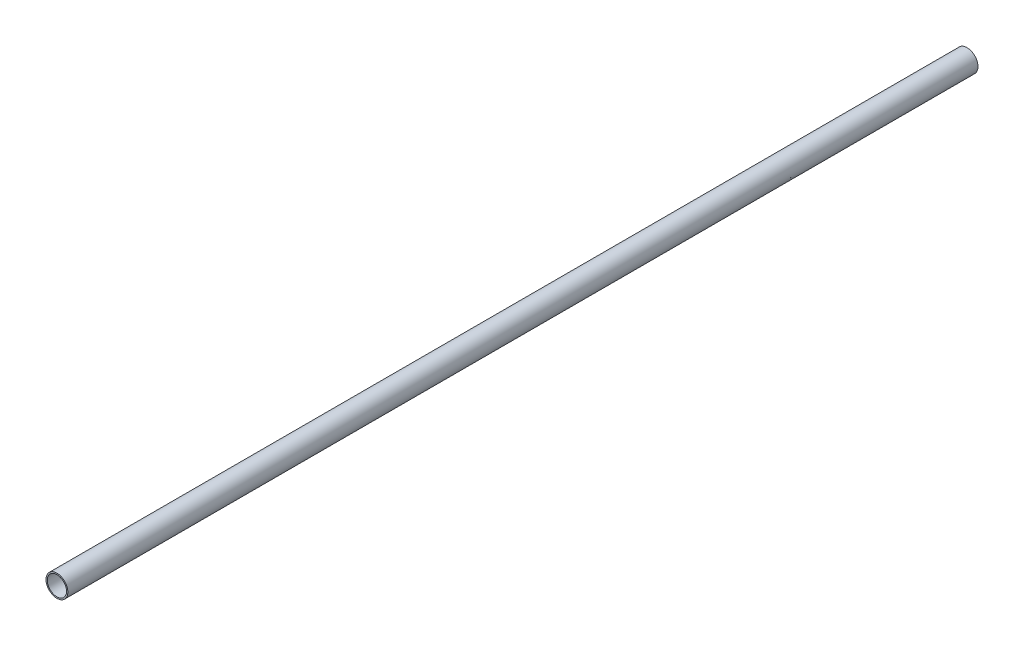
ISO-10303-21;
HEADER;
FILE_DESCRIPTION(('STEP AP214'),'2;1');
FILE_NAME('part.step','',(''),(''),'','','');
FILE_SCHEMA(('AUTOMOTIVE_DESIGN { 1 0 10303 214 1 1 1 1 }'));
ENDSEC;
DATA;
#1=APPLICATION_CONTEXT('core data for automotive mechanical design processes');
#2=APPLICATION_PROTOCOL_DEFINITION('international standard','automotive_design',2000,#1);
#3=PRODUCT_CONTEXT('',#1,'mechanical');
#4=PRODUCT('Part','Part','',(#3));
#5=PRODUCT_RELATED_PRODUCT_CATEGORY('part','',(#4));
#6=PRODUCT_DEFINITION_FORMATION('','',#4);
#7=PRODUCT_DEFINITION_CONTEXT('part definition',#1,'design');
#8=PRODUCT_DEFINITION('design','',#6,#7);
#9=PRODUCT_DEFINITION_SHAPE('','',#8);
#10=(LENGTH_UNIT() NAMED_UNIT(*) SI_UNIT(.MILLI.,.METRE.));
#11=(NAMED_UNIT(*) PLANE_ANGLE_UNIT() SI_UNIT($,.RADIAN.));
#12=(NAMED_UNIT(*) SI_UNIT($,.STERADIAN.) SOLID_ANGLE_UNIT());
#13=UNCERTAINTY_MEASURE_WITH_UNIT(LENGTH_MEASURE(1.E-05),#10,'distance_accuracy_value','');
#14=(GEOMETRIC_REPRESENTATION_CONTEXT(3) GLOBAL_UNCERTAINTY_ASSIGNED_CONTEXT((#13)) GLOBAL_UNIT_ASSIGNED_CONTEXT((#10,
#11,#12)) REPRESENTATION_CONTEXT('',''));
#15=CARTESIAN_POINT('',(0.,0.,0.));
#16=DIRECTION('',(0.,0.,1.));
#17=DIRECTION('',(1.,0.,0.));
#18=AXIS2_PLACEMENT_3D('',#15,#16,#17);
#19=CARTESIAN_POINT('',(0.,1269.,-3240.));
#20=DIRECTION('',(0.,0.,1.));
#21=DIRECTION('',(1.,0.,0.));
#22=AXIS2_PLACEMENT_3D('',#19,#20,#21);
#23=CYLINDRICAL_SURFACE('',#22,12.5);
#24=CARTESIAN_POINT('',(0.,1269.,-2180.));
#25=DIRECTION('',(0.,0.,1.));
#26=DIRECTION('',(1.,0.,0.));
#27=AXIS2_PLACEMENT_3D('',#24,#25,#26);
#28=CIRCLE('',#27,12.5);
#29=CARTESIAN_POINT('',(12.5,1269.,-2180.));
#30=VERTEX_POINT('',#29);
#31=EDGE_CURVE('E48',#30,#30,#28,.T.);
#32=ORIENTED_EDGE('',*,*,#31,.F.);
#33=EDGE_LOOP('',(#32));
#34=FACE_BOUND('',#33,.T.);
#35=CARTESIAN_POINT('',(0.,1269.,-3220.));
#36=DIRECTION('',(0.,0.,-1.));
#37=DIRECTION('',(-1.,0.,0.));
#38=AXIS2_PLACEMENT_3D('',#35,#36,#37);
#39=CIRCLE('',#38,12.5);
#40=CARTESIAN_POINT('',(-12.5,1269.,-3220.));
#41=VERTEX_POINT('',#40);
#42=EDGE_CURVE('E50',#41,#41,#39,.T.);
#43=ORIENTED_EDGE('',*,*,#42,.F.);
#44=EDGE_LOOP('',(#43));
#45=FACE_BOUND('',#44,.T.);
#46=ADVANCED_FACE('F37',(#34,#45),#23,.T.);
#47=CARTESIAN_POINT('',(-15.5,1960.,-3220.));
#48=DIRECTION('',(0.,0.,-1.));
#49=DIRECTION('',(-1.,0.,0.));
#50=AXIS2_PLACEMENT_3D('',#47,#48,#49);
#51=PLANE('',#50);
#52=CARTESIAN_POINT('',(0.,1269.,-3220.));
#53=DIRECTION('',(0.,0.,-1.));
#54=DIRECTION('',(-1.,0.,0.));
#55=AXIS2_PLACEMENT_3D('',#52,#53,#54);
#56=CIRCLE('',#55,11.);
#57=CARTESIAN_POINT('',(-11.,1269.,-3220.));
#58=VERTEX_POINT('',#57);
#59=EDGE_CURVE('E41',#58,#58,#56,.T.);
#60=ORIENTED_EDGE('',*,*,#59,.F.);
#61=EDGE_LOOP('',(#60));
#62=FACE_BOUND('',#61,.T.);
#63=ORIENTED_EDGE('',*,*,#42,.T.);
#64=EDGE_LOOP('',(#63));
#65=FACE_BOUND('',#64,.T.);
#66=ADVANCED_FACE('F60',(#62,#65),#51,.T.);
#67=CARTESIAN_POINT('',(-15.5,0.,-2180.));
#68=DIRECTION('',(0.,0.,1.));
#69=DIRECTION('',(1.,0.,0.));
#70=AXIS2_PLACEMENT_3D('',#67,#68,#69);
#71=PLANE('',#70);
#72=CARTESIAN_POINT('',(0.,1269.,-2180.));
#73=DIRECTION('',(0.,0.,1.));
#74=DIRECTION('',(1.,0.,0.));
#75=AXIS2_PLACEMENT_3D('',#72,#73,#74);
#76=CIRCLE('',#75,11.);
#77=CARTESIAN_POINT('',(11.,1269.,-2180.));
#78=VERTEX_POINT('',#77);
#79=EDGE_CURVE('E10',#78,#78,#76,.T.);
#80=ORIENTED_EDGE('',*,*,#79,.F.);
#81=EDGE_LOOP('',(#80));
#82=FACE_BOUND('',#81,.T.);
#83=ORIENTED_EDGE('',*,*,#31,.T.);
#84=EDGE_LOOP('',(#83));
#85=FACE_BOUND('',#84,.T.);
#86=ADVANCED_FACE('F56',(#82,#85),#71,.T.);
#87=CARTESIAN_POINT('',(0.,1269.,-3240.));
#88=DIRECTION('',(0.,0.,1.));
#89=DIRECTION('',(1.,0.,0.));
#90=AXIS2_PLACEMENT_3D('',#87,#88,#89);
#91=CYLINDRICAL_SURFACE('',#90,11.);
#92=ORIENTED_EDGE('',*,*,#59,.T.);
#93=EDGE_LOOP('',(#92));
#94=FACE_BOUND('',#93,.T.);
#95=ORIENTED_EDGE('',*,*,#79,.T.);
#96=EDGE_LOOP('',(#95));
#97=FACE_BOUND('',#96,.T.);
#98=ADVANCED_FACE('F39',(#94,#97),#91,.F.);
#99=CLOSED_SHELL('',(#46,#66,#86,#98));
#100=MANIFOLD_SOLID_BREP('B2',#99);
#101=ADVANCED_BREP_SHAPE_REPRESENTATION('',(#18,#100),#14);
#102=SHAPE_DEFINITION_REPRESENTATION(#9,#101);
ENDSEC;
END-ISO-10303-21;
